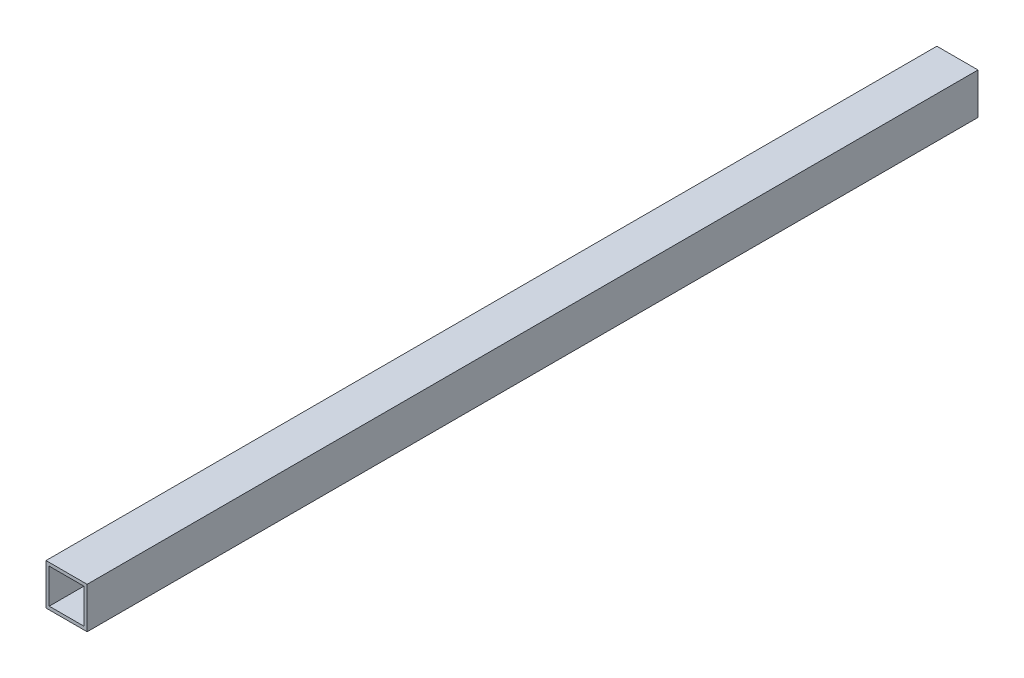
ISO-10303-21;
HEADER;
FILE_DESCRIPTION(('STEP AP214'),'2;1');
FILE_NAME('part.step','',(''),(''),'','','');
FILE_SCHEMA(('AUTOMOTIVE_DESIGN { 1 0 10303 214 1 1 1 1 }'));
ENDSEC;
DATA;
#1=APPLICATION_CONTEXT('core data for automotive mechanical design processes');
#2=APPLICATION_PROTOCOL_DEFINITION('international standard','automotive_design',2000,#1);
#3=PRODUCT_CONTEXT('',#1,'mechanical');
#4=PRODUCT('Part','Part','',(#3));
#5=PRODUCT_RELATED_PRODUCT_CATEGORY('part','',(#4));
#6=PRODUCT_DEFINITION_FORMATION('','',#4);
#7=PRODUCT_DEFINITION_CONTEXT('part definition',#1,'design');
#8=PRODUCT_DEFINITION('design','',#6,#7);
#9=PRODUCT_DEFINITION_SHAPE('','',#8);
#10=(LENGTH_UNIT() NAMED_UNIT(*) SI_UNIT(.MILLI.,.METRE.));
#11=(NAMED_UNIT(*) PLANE_ANGLE_UNIT() SI_UNIT($,.RADIAN.));
#12=(NAMED_UNIT(*) SI_UNIT($,.STERADIAN.) SOLID_ANGLE_UNIT());
#13=UNCERTAINTY_MEASURE_WITH_UNIT(LENGTH_MEASURE(1.E-05),#10,'distance_accuracy_value','');
#14=(GEOMETRIC_REPRESENTATION_CONTEXT(3) GLOBAL_UNCERTAINTY_ASSIGNED_CONTEXT((#13)) GLOBAL_UNIT_ASSIGNED_CONTEXT((#10,
#11,#12)) REPRESENTATION_CONTEXT('',''));
#15=CARTESIAN_POINT('',(0.,0.,0.));
#16=DIRECTION('',(0.,0.,1.));
#17=DIRECTION('',(1.,0.,0.));
#18=AXIS2_PLACEMENT_3D('',#15,#16,#17);
#19=CARTESIAN_POINT('',(0.,0.,550.));
#20=DIRECTION('',(0.,0.,-1.));
#21=DIRECTION('',(-1.,0.,0.));
#22=AXIS2_PLACEMENT_3D('',#19,#20,#21);
#23=PLANE('',#22);
#24=DIRECTION('',(0.,1.,0.));
#25=VECTOR('',#24,1.);
#26=CARTESIAN_POINT('',(12.7,-12.7,550.));
#27=LINE('',#26,#25);
#28=CARTESIAN_POINT('',(12.7,-12.7,550.));
#29=VERTEX_POINT('',#28);
#30=CARTESIAN_POINT('',(12.7,12.7,550.));
#31=VERTEX_POINT('',#30);
#32=EDGE_CURVE('E157',#29,#31,#27,.T.);
#33=ORIENTED_EDGE('',*,*,#32,.T.);
#34=DIRECTION('',(-1.,0.,0.));
#35=VECTOR('',#34,1.);
#36=CARTESIAN_POINT('',(-12.7,12.7,550.));
#37=LINE('',#36,#35);
#38=CARTESIAN_POINT('',(-12.7,12.7,550.));
#39=VERTEX_POINT('',#38);
#40=EDGE_CURVE('E161',#31,#39,#37,.T.);
#41=ORIENTED_EDGE('',*,*,#40,.T.);
#42=DIRECTION('',(0.,-1.,0.));
#43=VECTOR('',#42,1.);
#44=CARTESIAN_POINT('',(-12.7,-12.7,550.));
#45=LINE('',#44,#43);
#46=CARTESIAN_POINT('',(-12.7,-12.7,550.));
#47=VERTEX_POINT('',#46);
#48=EDGE_CURVE('E165',#39,#47,#45,.T.);
#49=ORIENTED_EDGE('',*,*,#48,.T.);
#50=DIRECTION('',(1.,0.,0.));
#51=VECTOR('',#50,1.);
#52=CARTESIAN_POINT('',(-12.7,-12.7,550.));
#53=LINE('',#52,#51);
#54=EDGE_CURVE('E168',#47,#29,#53,.T.);
#55=ORIENTED_EDGE('',*,*,#54,.T.);
#56=EDGE_LOOP('',(#33,#41,#49,#55));
#57=FACE_BOUND('',#56,.T.);
#58=DIRECTION('',(0.,-1.,0.));
#59=VECTOR('',#58,1.);
#60=CARTESIAN_POINT('',(-10.7,-10.7,550.));
#61=LINE('',#60,#59);
#62=CARTESIAN_POINT('',(-10.7,10.7,550.));
#63=VERTEX_POINT('',#62);
#64=CARTESIAN_POINT('',(-10.7,-10.7,550.));
#65=VERTEX_POINT('',#64);
#66=EDGE_CURVE('E109',#63,#65,#61,.T.);
#67=ORIENTED_EDGE('',*,*,#66,.F.);
#68=DIRECTION('',(-1.,0.,0.));
#69=VECTOR('',#68,1.);
#70=CARTESIAN_POINT('',(-10.7,10.7,550.));
#71=LINE('',#70,#69);
#72=CARTESIAN_POINT('',(10.7,10.7,550.));
#73=VERTEX_POINT('',#72);
#74=EDGE_CURVE('E135',#73,#63,#71,.T.);
#75=ORIENTED_EDGE('',*,*,#74,.F.);
#76=DIRECTION('',(0.,1.,0.));
#77=VECTOR('',#76,1.);
#78=CARTESIAN_POINT('',(10.7,-10.7,550.));
#79=LINE('',#78,#77);
#80=CARTESIAN_POINT('',(10.7,-10.7,550.));
#81=VERTEX_POINT('',#80);
#82=EDGE_CURVE('E131',#81,#73,#79,.T.);
#83=ORIENTED_EDGE('',*,*,#82,.F.);
#84=DIRECTION('',(1.,0.,0.));
#85=VECTOR('',#84,1.);
#86=CARTESIAN_POINT('',(-10.7,-10.7,550.));
#87=LINE('',#86,#85);
#88=EDGE_CURVE('E118',#65,#81,#87,.T.);
#89=ORIENTED_EDGE('',*,*,#88,.F.);
#90=EDGE_LOOP('',(#67,#75,#83,#89));
#91=FACE_BOUND('',#90,.T.);
#92=ADVANCED_FACE('F43',(#57,#91),#23,.F.);
#93=CARTESIAN_POINT('',(0.,0.,0.));
#94=DIRECTION('',(0.,0.,-1.));
#95=DIRECTION('',(-1.,0.,0.));
#96=AXIS2_PLACEMENT_3D('',#93,#94,#95);
#97=PLANE('',#96);
#98=DIRECTION('',(0.,1.,0.));
#99=VECTOR('',#98,1.);
#100=CARTESIAN_POINT('',(12.7,-12.7,0.));
#101=LINE('',#100,#99);
#102=CARTESIAN_POINT('',(12.7,-12.7,0.));
#103=VERTEX_POINT('',#102);
#104=CARTESIAN_POINT('',(12.7,12.7,0.));
#105=VERTEX_POINT('',#104);
#106=EDGE_CURVE('E127',#103,#105,#101,.T.);
#107=ORIENTED_EDGE('',*,*,#106,.F.);
#108=DIRECTION('',(1.,0.,0.));
#109=VECTOR('',#108,1.);
#110=CARTESIAN_POINT('',(-12.7,-12.7,0.));
#111=LINE('',#110,#109);
#112=CARTESIAN_POINT('',(-12.7,-12.7,0.));
#113=VERTEX_POINT('',#112);
#114=EDGE_CURVE('E162',#113,#103,#111,.T.);
#115=ORIENTED_EDGE('',*,*,#114,.F.);
#116=DIRECTION('',(0.,-1.,0.));
#117=VECTOR('',#116,1.);
#118=CARTESIAN_POINT('',(-12.7,-12.7,0.));
#119=LINE('',#118,#117);
#120=CARTESIAN_POINT('',(-12.7,12.7,0.));
#121=VERTEX_POINT('',#120);
#122=EDGE_CURVE('E178',#121,#113,#119,.T.);
#123=ORIENTED_EDGE('',*,*,#122,.F.);
#124=DIRECTION('',(-1.,0.,0.));
#125=VECTOR('',#124,1.);
#126=CARTESIAN_POINT('',(-12.7,12.7,0.));
#127=LINE('',#126,#125);
#128=EDGE_CURVE('E175',#105,#121,#127,.T.);
#129=ORIENTED_EDGE('',*,*,#128,.F.);
#130=EDGE_LOOP('',(#107,#115,#123,#129));
#131=FACE_BOUND('',#130,.T.);
#132=DIRECTION('',(-1.,0.,0.));
#133=VECTOR('',#132,1.);
#134=CARTESIAN_POINT('',(-10.7,10.7,0.));
#135=LINE('',#134,#133);
#136=CARTESIAN_POINT('',(10.7,10.7,0.));
#137=VERTEX_POINT('',#136);
#138=CARTESIAN_POINT('',(-10.7,10.7,0.));
#139=VERTEX_POINT('',#138);
#140=EDGE_CURVE('E119',#137,#139,#135,.T.);
#141=ORIENTED_EDGE('',*,*,#140,.T.);
#142=DIRECTION('',(0.,-1.,0.));
#143=VECTOR('',#142,1.);
#144=CARTESIAN_POINT('',(-10.7,-10.7,0.));
#145=LINE('',#144,#143);
#146=CARTESIAN_POINT('',(-10.7,-10.7,0.));
#147=VERTEX_POINT('',#146);
#148=EDGE_CURVE('E67',#139,#147,#145,.T.);
#149=ORIENTED_EDGE('',*,*,#148,.T.);
#150=DIRECTION('',(1.,0.,0.));
#151=VECTOR('',#150,1.);
#152=CARTESIAN_POINT('',(-10.7,-10.7,0.));
#153=LINE('',#152,#151);
#154=CARTESIAN_POINT('',(10.7,-10.7,0.));
#155=VERTEX_POINT('',#154);
#156=EDGE_CURVE('E125',#147,#155,#153,.T.);
#157=ORIENTED_EDGE('',*,*,#156,.T.);
#158=DIRECTION('',(0.,1.,0.));
#159=VECTOR('',#158,1.);
#160=CARTESIAN_POINT('',(10.7,-10.7,0.));
#161=LINE('',#160,#159);
#162=EDGE_CURVE('E144',#155,#137,#161,.T.);
#163=ORIENTED_EDGE('',*,*,#162,.T.);
#164=EDGE_LOOP('',(#141,#149,#157,#163));
#165=FACE_BOUND('',#164,.T.);
#166=ADVANCED_FACE('F201',(#131,#165),#97,.T.);
#167=CARTESIAN_POINT('',(12.7,-12.7,550.));
#168=DIRECTION('',(-1.,0.,0.));
#169=DIRECTION('',(0.,0.,1.));
#170=AXIS2_PLACEMENT_3D('',#167,#168,#169);
#171=PLANE('',#170);
#172=ORIENTED_EDGE('',*,*,#106,.T.);
#173=DIRECTION('',(0.,0.,-1.));
#174=VECTOR('',#173,1.);
#175=CARTESIAN_POINT('',(12.7,12.7,550.));
#176=LINE('',#175,#174);
#177=EDGE_CURVE('E11',#31,#105,#176,.T.);
#178=ORIENTED_EDGE('',*,*,#177,.F.);
#179=ORIENTED_EDGE('',*,*,#32,.F.);
#180=DIRECTION('',(0.,0.,-1.));
#181=VECTOR('',#180,1.);
#182=CARTESIAN_POINT('',(12.7,-12.7,550.));
#183=LINE('',#182,#181);
#184=EDGE_CURVE('E171',#29,#103,#183,.T.);
#185=ORIENTED_EDGE('',*,*,#184,.T.);
#186=EDGE_LOOP('',(#172,#178,#179,#185));
#187=FACE_BOUND('',#186,.T.);
#188=ADVANCED_FACE('F45',(#187),#171,.F.);
#189=CARTESIAN_POINT('',(-12.7,12.7,550.));
#190=DIRECTION('',(0.,-1.,0.));
#191=DIRECTION('',(0.,0.,-1.));
#192=AXIS2_PLACEMENT_3D('',#189,#190,#191);
#193=PLANE('',#192);
#194=ORIENTED_EDGE('',*,*,#128,.T.);
#195=DIRECTION('',(0.,0.,-1.));
#196=VECTOR('',#195,1.);
#197=CARTESIAN_POINT('',(-12.7,12.7,550.));
#198=LINE('',#197,#196);
#199=EDGE_CURVE('E52',#39,#121,#198,.T.);
#200=ORIENTED_EDGE('',*,*,#199,.F.);
#201=ORIENTED_EDGE('',*,*,#40,.F.);
#202=ORIENTED_EDGE('',*,*,#177,.T.);
#203=EDGE_LOOP('',(#194,#200,#201,#202));
#204=FACE_BOUND('',#203,.T.);
#205=ADVANCED_FACE('F211',(#204),#193,.F.);
#206=CARTESIAN_POINT('',(-12.7,-12.7,550.));
#207=DIRECTION('',(1.,0.,0.));
#208=DIRECTION('',(0.,0.,-1.));
#209=AXIS2_PLACEMENT_3D('',#206,#207,#208);
#210=PLANE('',#209);
#211=ORIENTED_EDGE('',*,*,#122,.T.);
#212=DIRECTION('',(0.,0.,-1.));
#213=VECTOR('',#212,1.);
#214=CARTESIAN_POINT('',(-12.7,-12.7,550.));
#215=LINE('',#214,#213);
#216=EDGE_CURVE('E186',#47,#113,#215,.T.);
#217=ORIENTED_EDGE('',*,*,#216,.F.);
#218=ORIENTED_EDGE('',*,*,#48,.F.);
#219=ORIENTED_EDGE('',*,*,#199,.T.);
#220=EDGE_LOOP('',(#211,#217,#218,#219));
#221=FACE_BOUND('',#220,.T.);
#222=ADVANCED_FACE('F195',(#221),#210,.F.);
#223=CARTESIAN_POINT('',(-12.7,-12.7,550.));
#224=DIRECTION('',(0.,1.,0.));
#225=DIRECTION('',(0.,0.,1.));
#226=AXIS2_PLACEMENT_3D('',#223,#224,#225);
#227=PLANE('',#226);
#228=ORIENTED_EDGE('',*,*,#114,.T.);
#229=ORIENTED_EDGE('',*,*,#184,.F.);
#230=ORIENTED_EDGE('',*,*,#54,.F.);
#231=ORIENTED_EDGE('',*,*,#216,.T.);
#232=EDGE_LOOP('',(#228,#229,#230,#231));
#233=FACE_BOUND('',#232,.T.);
#234=ADVANCED_FACE('F205',(#233),#227,.F.);
#235=CARTESIAN_POINT('',(-10.7,-10.7,550.));
#236=DIRECTION('',(1.,0.,0.));
#237=DIRECTION('',(0.,0.,-1.));
#238=AXIS2_PLACEMENT_3D('',#235,#236,#237);
#239=PLANE('',#238);
#240=ORIENTED_EDGE('',*,*,#148,.F.);
#241=DIRECTION('',(0.,0.,-1.));
#242=VECTOR('',#241,1.);
#243=CARTESIAN_POINT('',(-10.7,10.7,550.));
#244=LINE('',#243,#242);
#245=EDGE_CURVE('E113',#63,#139,#244,.T.);
#246=ORIENTED_EDGE('',*,*,#245,.F.);
#247=ORIENTED_EDGE('',*,*,#66,.T.);
#248=DIRECTION('',(0.,0.,-1.));
#249=VECTOR('',#248,1.);
#250=CARTESIAN_POINT('',(-10.7,-10.7,550.));
#251=LINE('',#250,#249);
#252=EDGE_CURVE('E112',#65,#147,#251,.T.);
#253=ORIENTED_EDGE('',*,*,#252,.T.);
#254=EDGE_LOOP('',(#240,#246,#247,#253));
#255=FACE_BOUND('',#254,.T.);
#256=ADVANCED_FACE('F111',(#255),#239,.T.);
#257=CARTESIAN_POINT('',(-10.7,-10.7,550.));
#258=DIRECTION('',(0.,1.,0.));
#259=DIRECTION('',(0.,0.,1.));
#260=AXIS2_PLACEMENT_3D('',#257,#258,#259);
#261=PLANE('',#260);
#262=ORIENTED_EDGE('',*,*,#156,.F.);
#263=ORIENTED_EDGE('',*,*,#252,.F.);
#264=ORIENTED_EDGE('',*,*,#88,.T.);
#265=DIRECTION('',(0.,0.,-1.));
#266=VECTOR('',#265,1.);
#267=CARTESIAN_POINT('',(10.7,-10.7,550.));
#268=LINE('',#267,#266);
#269=EDGE_CURVE('E128',#81,#155,#268,.T.);
#270=ORIENTED_EDGE('',*,*,#269,.T.);
#271=EDGE_LOOP('',(#262,#263,#264,#270));
#272=FACE_BOUND('',#271,.T.);
#273=ADVANCED_FACE('F122',(#272),#261,.T.);
#274=CARTESIAN_POINT('',(10.7,-10.7,550.));
#275=DIRECTION('',(-1.,0.,0.));
#276=DIRECTION('',(0.,0.,1.));
#277=AXIS2_PLACEMENT_3D('',#274,#275,#276);
#278=PLANE('',#277);
#279=ORIENTED_EDGE('',*,*,#162,.F.);
#280=ORIENTED_EDGE('',*,*,#269,.F.);
#281=ORIENTED_EDGE('',*,*,#82,.T.);
#282=DIRECTION('',(0.,0.,-1.));
#283=VECTOR('',#282,1.);
#284=CARTESIAN_POINT('',(10.7,10.7,550.));
#285=LINE('',#284,#283);
#286=EDGE_CURVE('E59',#73,#137,#285,.T.);
#287=ORIENTED_EDGE('',*,*,#286,.T.);
#288=EDGE_LOOP('',(#279,#280,#281,#287));
#289=FACE_BOUND('',#288,.T.);
#290=ADVANCED_FACE('F234',(#289),#278,.T.);
#291=CARTESIAN_POINT('',(-10.7,10.7,550.));
#292=DIRECTION('',(0.,-1.,0.));
#293=DIRECTION('',(0.,0.,-1.));
#294=AXIS2_PLACEMENT_3D('',#291,#292,#293);
#295=PLANE('',#294);
#296=ORIENTED_EDGE('',*,*,#140,.F.);
#297=ORIENTED_EDGE('',*,*,#286,.F.);
#298=ORIENTED_EDGE('',*,*,#74,.T.);
#299=ORIENTED_EDGE('',*,*,#245,.T.);
#300=EDGE_LOOP('',(#296,#297,#298,#299));
#301=FACE_BOUND('',#300,.T.);
#302=ADVANCED_FACE('F238',(#301),#295,.T.);
#303=CLOSED_SHELL('',(#92,#166,#188,#205,#222,#234,#256,#273,#290,#302));
#304=MANIFOLD_SOLID_BREP('B2',#303);
#305=ADVANCED_BREP_SHAPE_REPRESENTATION('',(#18,#304),#14);
#306=SHAPE_DEFINITION_REPRESENTATION(#9,#305);
ENDSEC;
END-ISO-10303-21;
